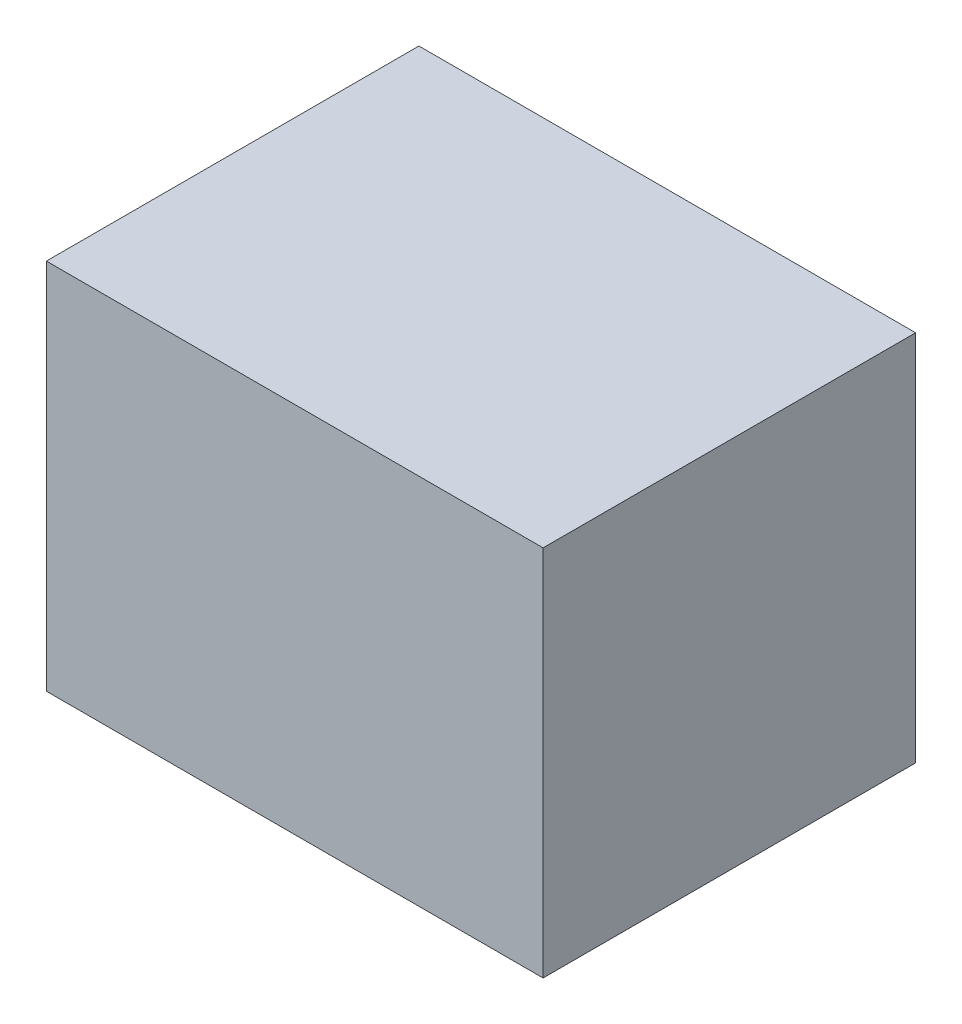
ISO-10303-21;
HEADER;
FILE_DESCRIPTION(('STEP AP214'),'2;1');
FILE_NAME('part.step','',(''),(''),'','','');
FILE_SCHEMA(('AUTOMOTIVE_DESIGN { 1 0 10303 214 1 1 1 1 }'));
ENDSEC;
DATA;
#1=APPLICATION_CONTEXT('core data for automotive mechanical design processes');
#2=APPLICATION_PROTOCOL_DEFINITION('international standard','automotive_design',2000,#1);
#3=PRODUCT_CONTEXT('',#1,'mechanical');
#4=PRODUCT('Part','Part','',(#3));
#5=PRODUCT_RELATED_PRODUCT_CATEGORY('part','',(#4));
#6=PRODUCT_DEFINITION_FORMATION('','',#4);
#7=PRODUCT_DEFINITION_CONTEXT('part definition',#1,'design');
#8=PRODUCT_DEFINITION('design','',#6,#7);
#9=PRODUCT_DEFINITION_SHAPE('','',#8);
#10=(LENGTH_UNIT() NAMED_UNIT(*) SI_UNIT(.MILLI.,.METRE.));
#11=(NAMED_UNIT(*) PLANE_ANGLE_UNIT() SI_UNIT($,.RADIAN.));
#12=(NAMED_UNIT(*) SI_UNIT($,.STERADIAN.) SOLID_ANGLE_UNIT());
#13=UNCERTAINTY_MEASURE_WITH_UNIT(LENGTH_MEASURE(1.E-05),#10,'distance_accuracy_value','');
#14=(GEOMETRIC_REPRESENTATION_CONTEXT(3) GLOBAL_UNCERTAINTY_ASSIGNED_CONTEXT((#13)) GLOBAL_UNIT_ASSIGNED_CONTEXT((#10,
#11,#12)) REPRESENTATION_CONTEXT('',''));
#15=CARTESIAN_POINT('',(0.,0.,0.));
#16=DIRECTION('',(0.,0.,1.));
#17=DIRECTION('',(1.,0.,0.));
#18=AXIS2_PLACEMENT_3D('',#15,#16,#17);
#19=CARTESIAN_POINT('',(6.35,0.,9.525));
#20=DIRECTION('',(0.,0.,-1.));
#21=DIRECTION('',(0.,1.,0.));
#22=AXIS2_PLACEMENT_3D('',#19,#20,#21);
#23=PLANE('',#22);
#24=DIRECTION('',(0.,-1.,0.));
#25=VECTOR('',#24,1.);
#26=CARTESIAN_POINT('',(-6.35,0.,9.525));
#27=LINE('',#26,#25);
#28=CARTESIAN_POINT('',(-6.35,9.525,9.525));
#29=VERTEX_POINT('',#28);
#30=CARTESIAN_POINT('',(-6.35,0.,9.525));
#31=VERTEX_POINT('',#30);
#32=EDGE_CURVE('E109',#29,#31,#27,.T.);
#33=ORIENTED_EDGE('',*,*,#32,.T.);
#34=DIRECTION('',(-1.,0.,0.));
#35=VECTOR('',#34,1.);
#36=CARTESIAN_POINT('',(6.35,0.,9.525));
#37=LINE('',#36,#35);
#38=CARTESIAN_POINT('',(6.35,0.,9.525));
#39=VERTEX_POINT('',#38);
#40=EDGE_CURVE('E11',#39,#31,#37,.T.);
#41=ORIENTED_EDGE('',*,*,#40,.F.);
#42=DIRECTION('',(0.,-1.,0.));
#43=VECTOR('',#42,1.);
#44=CARTESIAN_POINT('',(6.35,0.,9.525));
#45=LINE('',#44,#43);
#46=CARTESIAN_POINT('',(6.35,9.525,9.525));
#47=VERTEX_POINT('',#46);
#48=EDGE_CURVE('E93',#47,#39,#45,.T.);
#49=ORIENTED_EDGE('',*,*,#48,.F.);
#50=DIRECTION('',(-1.,0.,0.));
#51=VECTOR('',#50,1.);
#52=CARTESIAN_POINT('',(6.35,9.525,9.525));
#53=LINE('',#52,#51);
#54=EDGE_CURVE('E105',#47,#29,#53,.T.);
#55=ORIENTED_EDGE('',*,*,#54,.T.);
#56=EDGE_LOOP('',(#33,#41,#49,#55));
#57=FACE_BOUND('',#56,.T.);
#58=ADVANCED_FACE('F41',(#57),#23,.F.);
#59=CARTESIAN_POINT('',(6.35,0.,0.));
#60=DIRECTION('',(0.,1.,0.));
#61=DIRECTION('',(0.,0.,1.));
#62=AXIS2_PLACEMENT_3D('',#59,#60,#61);
#63=PLANE('',#62);
#64=DIRECTION('',(0.,0.,-1.));
#65=VECTOR('',#64,1.);
#66=CARTESIAN_POINT('',(-6.35,0.,0.));
#67=LINE('',#66,#65);
#68=CARTESIAN_POINT('',(-6.35,0.,0.));
#69=VERTEX_POINT('',#68);
#70=EDGE_CURVE('E98',#31,#69,#67,.T.);
#71=ORIENTED_EDGE('',*,*,#70,.T.);
#72=DIRECTION('',(-1.,0.,0.));
#73=VECTOR('',#72,1.);
#74=CARTESIAN_POINT('',(6.35,0.,0.));
#75=LINE('',#74,#73);
#76=CARTESIAN_POINT('',(6.35,0.,0.));
#77=VERTEX_POINT('',#76);
#78=EDGE_CURVE('E50',#77,#69,#75,.T.);
#79=ORIENTED_EDGE('',*,*,#78,.F.);
#80=DIRECTION('',(0.,0.,-1.));
#81=VECTOR('',#80,1.);
#82=CARTESIAN_POINT('',(6.35,0.,0.));
#83=LINE('',#82,#81);
#84=EDGE_CURVE('E88',#39,#77,#83,.T.);
#85=ORIENTED_EDGE('',*,*,#84,.F.);
#86=ORIENTED_EDGE('',*,*,#40,.T.);
#87=EDGE_LOOP('',(#71,#79,#85,#86));
#88=FACE_BOUND('',#87,.T.);
#89=ADVANCED_FACE('F97',(#88),#63,.F.);
#90=CARTESIAN_POINT('',(6.35,0.,0.));
#91=DIRECTION('',(0.,0.,1.));
#92=DIRECTION('',(1.,0.,0.));
#93=AXIS2_PLACEMENT_3D('',#90,#91,#92);
#94=PLANE('',#93);
#95=DIRECTION('',(0.,1.,0.));
#96=VECTOR('',#95,1.);
#97=CARTESIAN_POINT('',(-6.35,0.,0.));
#98=LINE('',#97,#96);
#99=CARTESIAN_POINT('',(-6.35,9.525,0.));
#100=VERTEX_POINT('',#99);
#101=EDGE_CURVE('E75',#69,#100,#98,.T.);
#102=ORIENTED_EDGE('',*,*,#101,.T.);
#103=DIRECTION('',(-1.,0.,0.));
#104=VECTOR('',#103,1.);
#105=CARTESIAN_POINT('',(6.35,9.525,0.));
#106=LINE('',#105,#104);
#107=CARTESIAN_POINT('',(6.35,9.525,0.));
#108=VERTEX_POINT('',#107);
#109=EDGE_CURVE('E100',#108,#100,#106,.T.);
#110=ORIENTED_EDGE('',*,*,#109,.F.);
#111=DIRECTION('',(0.,1.,0.));
#112=VECTOR('',#111,1.);
#113=CARTESIAN_POINT('',(6.35,0.,0.));
#114=LINE('',#113,#112);
#115=EDGE_CURVE('E91',#77,#108,#114,.T.);
#116=ORIENTED_EDGE('',*,*,#115,.F.);
#117=ORIENTED_EDGE('',*,*,#78,.T.);
#118=EDGE_LOOP('',(#102,#110,#116,#117));
#119=FACE_BOUND('',#118,.T.);
#120=ADVANCED_FACE('F101',(#119),#94,.F.);
#121=CARTESIAN_POINT('',(6.35,9.525,0.));
#122=DIRECTION('',(0.,-1.,0.));
#123=DIRECTION('',(0.,0.,-1.));
#124=AXIS2_PLACEMENT_3D('',#121,#122,#123);
#125=PLANE('',#124);
#126=DIRECTION('',(0.,0.,1.));
#127=VECTOR('',#126,1.);
#128=CARTESIAN_POINT('',(-6.35,9.525,0.));
#129=LINE('',#128,#127);
#130=EDGE_CURVE('E81',#100,#29,#129,.T.);
#131=ORIENTED_EDGE('',*,*,#130,.T.);
#132=ORIENTED_EDGE('',*,*,#54,.F.);
#133=DIRECTION('',(0.,0.,1.));
#134=VECTOR('',#133,1.);
#135=CARTESIAN_POINT('',(6.35,9.525,0.));
#136=LINE('',#135,#134);
#137=EDGE_CURVE('E58',#108,#47,#136,.T.);
#138=ORIENTED_EDGE('',*,*,#137,.F.);
#139=ORIENTED_EDGE('',*,*,#109,.T.);
#140=EDGE_LOOP('',(#131,#132,#138,#139));
#141=FACE_BOUND('',#140,.T.);
#142=ADVANCED_FACE('F122',(#141),#125,.F.);
#143=CARTESIAN_POINT('',(6.35,0.,0.));
#144=DIRECTION('',(1.,0.,0.));
#145=DIRECTION('',(0.,0.,-1.));
#146=AXIS2_PLACEMENT_3D('',#143,#144,#145);
#147=PLANE('',#146);
#148=ORIENTED_EDGE('',*,*,#48,.T.);
#149=ORIENTED_EDGE('',*,*,#84,.T.);
#150=ORIENTED_EDGE('',*,*,#115,.T.);
#151=ORIENTED_EDGE('',*,*,#137,.T.);
#152=EDGE_LOOP('',(#148,#149,#150,#151));
#153=FACE_BOUND('',#152,.T.);
#154=ADVANCED_FACE('F89',(#153),#147,.T.);
#155=CARTESIAN_POINT('',(-6.35,0.,0.));
#156=DIRECTION('',(1.,0.,0.));
#157=DIRECTION('',(0.,0.,-1.));
#158=AXIS2_PLACEMENT_3D('',#155,#156,#157);
#159=PLANE('',#158);
#160=ORIENTED_EDGE('',*,*,#32,.F.);
#161=ORIENTED_EDGE('',*,*,#130,.F.);
#162=ORIENTED_EDGE('',*,*,#101,.F.);
#163=ORIENTED_EDGE('',*,*,#70,.F.);
#164=EDGE_LOOP('',(#160,#161,#162,#163));
#165=FACE_BOUND('',#164,.T.);
#166=ADVANCED_FACE('F125',(#165),#159,.F.);
#167=CLOSED_SHELL('',(#58,#89,#120,#142,#154,#166));
#168=MANIFOLD_SOLID_BREP('B2',#167);
#169=ADVANCED_BREP_SHAPE_REPRESENTATION('',(#18,#168),#14);
#170=SHAPE_DEFINITION_REPRESENTATION(#9,#169);
ENDSEC;
END-ISO-10303-21;
